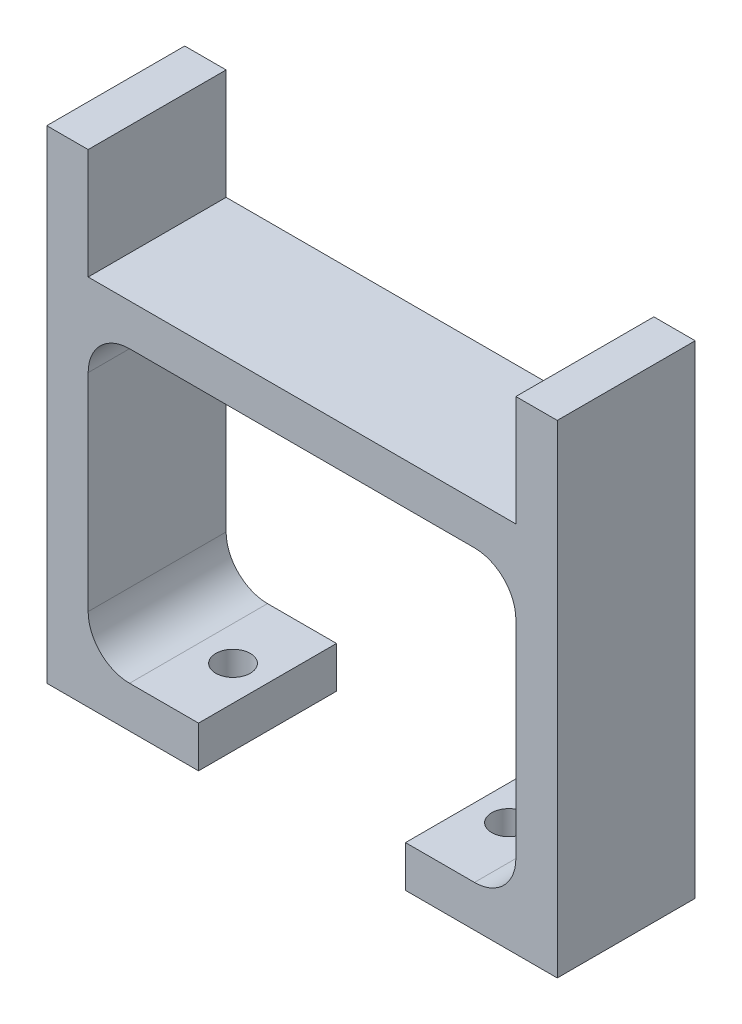
ISO-10303-21;
HEADER;
FILE_DESCRIPTION(('STEP AP214'),'2;1');
FILE_NAME('part.step','',(''),(''),'','','');
FILE_SCHEMA(('AUTOMOTIVE_DESIGN { 1 0 10303 214 1 1 1 1 }'));
ENDSEC;
DATA;
#1=APPLICATION_CONTEXT('core data for automotive mechanical design processes');
#2=APPLICATION_PROTOCOL_DEFINITION('international standard','automotive_design',2000,#1);
#3=PRODUCT_CONTEXT('',#1,'mechanical');
#4=PRODUCT('Part','Part','',(#3));
#5=PRODUCT_RELATED_PRODUCT_CATEGORY('part','',(#4));
#6=PRODUCT_DEFINITION_FORMATION('','',#4);
#7=PRODUCT_DEFINITION_CONTEXT('part definition',#1,'design');
#8=PRODUCT_DEFINITION('design','',#6,#7);
#9=PRODUCT_DEFINITION_SHAPE('','',#8);
#10=(LENGTH_UNIT() NAMED_UNIT(*) SI_UNIT(.MILLI.,.METRE.));
#11=(NAMED_UNIT(*) PLANE_ANGLE_UNIT() SI_UNIT($,.RADIAN.));
#12=(NAMED_UNIT(*) SI_UNIT($,.STERADIAN.) SOLID_ANGLE_UNIT());
#13=UNCERTAINTY_MEASURE_WITH_UNIT(LENGTH_MEASURE(1.E-05),#10,'distance_accuracy_value','');
#14=(GEOMETRIC_REPRESENTATION_CONTEXT(3) GLOBAL_UNCERTAINTY_ASSIGNED_CONTEXT((#13)) GLOBAL_UNIT_ASSIGNED_CONTEXT((#10,
#11,#12)) REPRESENTATION_CONTEXT('',''));
#15=CARTESIAN_POINT('',(0.,0.,0.));
#16=DIRECTION('',(0.,0.,1.));
#17=DIRECTION('',(1.,0.,0.));
#18=AXIS2_PLACEMENT_3D('',#15,#16,#17);
#19=CARTESIAN_POINT('',(-15.5,35.,10.));
#20=DIRECTION('',(-1.,0.,0.));
#21=DIRECTION('',(0.,-1.,0.));
#22=AXIS2_PLACEMENT_3D('',#19,#20,#21);
#23=PLANE('',#22);
#24=DIRECTION('',(0.,1.,0.));
#25=VECTOR('',#24,1.);
#26=CARTESIAN_POINT('',(-15.5,35.,0.));
#27=LINE('',#26,#25);
#28=CARTESIAN_POINT('',(-15.5,27.,0.));
#29=VERTEX_POINT('',#28);
#30=CARTESIAN_POINT('',(-15.5,35.,0.));
#31=VERTEX_POINT('',#30);
#32=EDGE_CURVE('E201',#29,#31,#27,.T.);
#33=ORIENTED_EDGE('',*,*,#32,.T.);
#34=DIRECTION('',(0.,0.,-1.));
#35=VECTOR('',#34,1.);
#36=CARTESIAN_POINT('',(-15.5,35.,10.));
#37=LINE('',#36,#35);
#38=CARTESIAN_POINT('',(-15.5,35.,10.));
#39=VERTEX_POINT('',#38);
#40=EDGE_CURVE('E11',#39,#31,#37,.T.);
#41=ORIENTED_EDGE('',*,*,#40,.F.);
#42=DIRECTION('',(0.,1.,0.));
#43=VECTOR('',#42,1.);
#44=CARTESIAN_POINT('',(-15.5,35.,10.));
#45=LINE('',#44,#43);
#46=CARTESIAN_POINT('',(-15.5,27.,10.));
#47=VERTEX_POINT('',#46);
#48=EDGE_CURVE('E240',#47,#39,#45,.T.);
#49=ORIENTED_EDGE('',*,*,#48,.F.);
#50=DIRECTION('',(0.,0.,-1.));
#51=VECTOR('',#50,1.);
#52=CARTESIAN_POINT('',(-15.5,27.,10.));
#53=LINE('',#52,#51);
#54=EDGE_CURVE('E197',#47,#29,#53,.T.);
#55=ORIENTED_EDGE('',*,*,#54,.T.);
#56=EDGE_LOOP('',(#33,#41,#49,#55));
#57=FACE_BOUND('',#56,.T.);
#58=ADVANCED_FACE('F33',(#57),#23,.F.);
#59=CARTESIAN_POINT('',(-18.5,35.,10.));
#60=DIRECTION('',(0.,-1.,0.));
#61=DIRECTION('',(0.,0.,-1.));
#62=AXIS2_PLACEMENT_3D('',#59,#60,#61);
#63=PLANE('',#62);
#64=DIRECTION('',(-1.,0.,0.));
#65=VECTOR('',#64,1.);
#66=CARTESIAN_POINT('',(-18.5,35.,0.));
#67=LINE('',#66,#65);
#68=CARTESIAN_POINT('',(-18.5,35.,0.));
#69=VERTEX_POINT('',#68);
#70=EDGE_CURVE('E204',#31,#69,#67,.T.);
#71=ORIENTED_EDGE('',*,*,#70,.T.);
#72=DIRECTION('',(0.,0.,-1.));
#73=VECTOR('',#72,1.);
#74=CARTESIAN_POINT('',(-18.5,35.,10.));
#75=LINE('',#74,#73);
#76=CARTESIAN_POINT('',(-18.5,35.,10.));
#77=VERTEX_POINT('',#76);
#78=EDGE_CURVE('E41',#77,#69,#75,.T.);
#79=ORIENTED_EDGE('',*,*,#78,.F.);
#80=DIRECTION('',(-1.,0.,0.));
#81=VECTOR('',#80,1.);
#82=CARTESIAN_POINT('',(-18.5,35.,10.));
#83=LINE('',#82,#81);
#84=EDGE_CURVE('E128',#39,#77,#83,.T.);
#85=ORIENTED_EDGE('',*,*,#84,.F.);
#86=ORIENTED_EDGE('',*,*,#40,.T.);
#87=EDGE_LOOP('',(#71,#79,#85,#86));
#88=FACE_BOUND('',#87,.T.);
#89=ADVANCED_FACE('F358',(#88),#63,.F.);
#90=CARTESIAN_POINT('',(-18.5,0.,10.));
#91=DIRECTION('',(1.,0.,0.));
#92=DIRECTION('',(0.,0.,-1.));
#93=AXIS2_PLACEMENT_3D('',#90,#91,#92);
#94=PLANE('',#93);
#95=DIRECTION('',(0.,-1.,0.));
#96=VECTOR('',#95,1.);
#97=CARTESIAN_POINT('',(-18.5,0.,0.));
#98=LINE('',#97,#96);
#99=CARTESIAN_POINT('',(-18.5,0.,0.));
#100=VERTEX_POINT('',#99);
#101=EDGE_CURVE('E207',#69,#100,#98,.T.);
#102=ORIENTED_EDGE('',*,*,#101,.T.);
#103=DIRECTION('',(0.,0.,-1.));
#104=VECTOR('',#103,1.);
#105=CARTESIAN_POINT('',(-18.5,0.,10.));
#106=LINE('',#105,#104);
#107=CARTESIAN_POINT('',(-18.5,0.,10.));
#108=VERTEX_POINT('',#107);
#109=EDGE_CURVE('E283',#108,#100,#106,.T.);
#110=ORIENTED_EDGE('',*,*,#109,.F.);
#111=DIRECTION('',(0.,-1.,0.));
#112=VECTOR('',#111,1.);
#113=CARTESIAN_POINT('',(-18.5,0.,10.));
#114=LINE('',#113,#112);
#115=EDGE_CURVE('E291',#77,#108,#114,.T.);
#116=ORIENTED_EDGE('',*,*,#115,.F.);
#117=ORIENTED_EDGE('',*,*,#78,.T.);
#118=EDGE_LOOP('',(#102,#110,#116,#117));
#119=FACE_BOUND('',#118,.T.);
#120=ADVANCED_FACE('F289',(#119),#94,.F.);
#121=CARTESIAN_POINT('',(-7.49999999999999,0.,10.));
#122=DIRECTION('',(0.,1.,0.));
#123=DIRECTION('',(-1.,0.,0.));
#124=AXIS2_PLACEMENT_3D('',#121,#122,#123);
#125=PLANE('',#124);
#126=CARTESIAN_POINT('',(-9.99999999999999,0.,5.));
#127=DIRECTION('',(0.,1.,0.));
#128=DIRECTION('',(0.,0.,1.));
#129=AXIS2_PLACEMENT_3D('',#126,#127,#128);
#130=CIRCLE('',#129,1.25);
#131=CARTESIAN_POINT('',(-9.99999999999999,0.,6.25));
#132=VERTEX_POINT('',#131);
#133=EDGE_CURVE('E205',#132,#132,#130,.T.);
#134=ORIENTED_EDGE('',*,*,#133,.T.);
#135=EDGE_LOOP('',(#134));
#136=FACE_BOUND('',#135,.T.);
#137=DIRECTION('',(1.,0.,0.));
#138=VECTOR('',#137,1.);
#139=CARTESIAN_POINT('',(-7.49999999999999,0.,0.));
#140=LINE('',#139,#138);
#141=CARTESIAN_POINT('',(-7.49999999999999,0.,0.));
#142=VERTEX_POINT('',#141);
#143=EDGE_CURVE('E209',#100,#142,#140,.T.);
#144=ORIENTED_EDGE('',*,*,#143,.T.);
#145=DIRECTION('',(0.,0.,-1.));
#146=VECTOR('',#145,1.);
#147=CARTESIAN_POINT('',(-7.49999999999999,0.,10.));
#148=LINE('',#147,#146);
#149=CARTESIAN_POINT('',(-7.49999999999999,0.,10.));
#150=VERTEX_POINT('',#149);
#151=EDGE_CURVE('E280',#150,#142,#148,.T.);
#152=ORIENTED_EDGE('',*,*,#151,.F.);
#153=DIRECTION('',(1.,0.,0.));
#154=VECTOR('',#153,1.);
#155=CARTESIAN_POINT('',(-7.49999999999999,0.,10.));
#156=LINE('',#155,#154);
#157=EDGE_CURVE('E309',#108,#150,#156,.T.);
#158=ORIENTED_EDGE('',*,*,#157,.F.);
#159=ORIENTED_EDGE('',*,*,#109,.T.);
#160=EDGE_LOOP('',(#144,#152,#158,#159));
#161=FACE_BOUND('',#160,.T.);
#162=ADVANCED_FACE('F300',(#136,#161),#125,.F.);
#163=CARTESIAN_POINT('',(-7.49999999999999,3.,10.));
#164=DIRECTION('',(-1.,0.,0.));
#165=DIRECTION('',(0.,0.,1.));
#166=AXIS2_PLACEMENT_3D('',#163,#164,#165);
#167=PLANE('',#166);
#168=DIRECTION('',(0.,1.,0.));
#169=VECTOR('',#168,1.);
#170=CARTESIAN_POINT('',(-7.49999999999999,3.,0.));
#171=LINE('',#170,#169);
#172=CARTESIAN_POINT('',(-7.49999999999999,3.,0.));
#173=VERTEX_POINT('',#172);
#174=EDGE_CURVE('E211',#142,#173,#171,.T.);
#175=ORIENTED_EDGE('',*,*,#174,.T.);
#176=DIRECTION('',(0.,0.,-1.));
#177=VECTOR('',#176,1.);
#178=CARTESIAN_POINT('',(-7.49999999999999,3.,10.));
#179=LINE('',#178,#177);
#180=CARTESIAN_POINT('',(-7.49999999999999,3.,10.));
#181=VERTEX_POINT('',#180);
#182=EDGE_CURVE('E277',#181,#173,#179,.T.);
#183=ORIENTED_EDGE('',*,*,#182,.F.);
#184=DIRECTION('',(0.,1.,0.));
#185=VECTOR('',#184,1.);
#186=CARTESIAN_POINT('',(-7.49999999999999,3.,10.));
#187=LINE('',#186,#185);
#188=EDGE_CURVE('E306',#150,#181,#187,.T.);
#189=ORIENTED_EDGE('',*,*,#188,.F.);
#190=ORIENTED_EDGE('',*,*,#151,.T.);
#191=EDGE_LOOP('',(#175,#183,#189,#190));
#192=FACE_BOUND('',#191,.T.);
#193=ADVANCED_FACE('F304',(#192),#167,.F.);
#194=CARTESIAN_POINT('',(-12.5,3.,10.));
#195=DIRECTION('',(0.,-1.,0.));
#196=DIRECTION('',(1.,0.,0.));
#197=AXIS2_PLACEMENT_3D('',#194,#195,#196);
#198=PLANE('',#197);
#199=CARTESIAN_POINT('',(-9.99999999999999,3.,5.));
#200=DIRECTION('',(0.,1.,0.));
#201=DIRECTION('',(0.,0.,1.));
#202=AXIS2_PLACEMENT_3D('',#199,#200,#201);
#203=CIRCLE('',#202,1.25);
#204=CARTESIAN_POINT('',(-9.99999999999999,3.,6.25));
#205=VERTEX_POINT('',#204);
#206=EDGE_CURVE('E502',#205,#205,#203,.T.);
#207=ORIENTED_EDGE('',*,*,#206,.F.);
#208=EDGE_LOOP('',(#207));
#209=FACE_BOUND('',#208,.T.);
#210=DIRECTION('',(-1.,0.,0.));
#211=VECTOR('',#210,1.);
#212=CARTESIAN_POINT('',(-12.5,3.,0.));
#213=LINE('',#212,#211);
#214=CARTESIAN_POINT('',(-12.5,3.,0.));
#215=VERTEX_POINT('',#214);
#216=EDGE_CURVE('E213',#173,#215,#213,.T.);
#217=ORIENTED_EDGE('',*,*,#216,.T.);
#218=DIRECTION('',(0.,0.,-1.));
#219=VECTOR('',#218,1.);
#220=CARTESIAN_POINT('',(-12.5,3.,10.));
#221=LINE('',#220,#219);
#222=CARTESIAN_POINT('',(-12.5,3.,10.));
#223=VERTEX_POINT('',#222);
#224=EDGE_CURVE('E274',#223,#215,#221,.T.);
#225=ORIENTED_EDGE('',*,*,#224,.F.);
#226=DIRECTION('',(-1.,0.,0.));
#227=VECTOR('',#226,1.);
#228=CARTESIAN_POINT('',(-12.5,3.,10.));
#229=LINE('',#228,#227);
#230=EDGE_CURVE('E308',#181,#223,#229,.T.);
#231=ORIENTED_EDGE('',*,*,#230,.F.);
#232=ORIENTED_EDGE('',*,*,#182,.T.);
#233=EDGE_LOOP('',(#217,#225,#231,#232));
#234=FACE_BOUND('',#233,.T.);
#235=ADVANCED_FACE('F372',(#209,#234),#198,.F.);
#236=CARTESIAN_POINT('',(-12.5,6.,10.));
#237=DIRECTION('',(0.,0.,-1.));
#238=DIRECTION('',(-1.,0.,0.));
#239=AXIS2_PLACEMENT_3D('',#236,#237,#238);
#240=CYLINDRICAL_SURFACE('',#239,2.99999999999999);
#241=CARTESIAN_POINT('',(-12.5,6.,0.));
#242=DIRECTION('',(0.,0.,-1.));
#243=DIRECTION('',(-1.,0.,0.));
#244=AXIS2_PLACEMENT_3D('',#241,#242,#243);
#245=CIRCLE('',#244,2.99999999999999);
#246=CARTESIAN_POINT('',(-15.5,6.,0.));
#247=VERTEX_POINT('',#246);
#248=EDGE_CURVE('E215',#215,#247,#245,.T.);
#249=ORIENTED_EDGE('',*,*,#248,.T.);
#250=DIRECTION('',(0.,0.,-1.));
#251=VECTOR('',#250,1.);
#252=CARTESIAN_POINT('',(-15.5,6.,10.));
#253=LINE('',#252,#251);
#254=CARTESIAN_POINT('',(-15.5,6.,10.));
#255=VERTEX_POINT('',#254);
#256=EDGE_CURVE('E271',#255,#247,#253,.T.);
#257=ORIENTED_EDGE('',*,*,#256,.F.);
#258=CARTESIAN_POINT('',(-12.5,6.,10.));
#259=DIRECTION('',(0.,0.,-1.));
#260=DIRECTION('',(-1.,0.,0.));
#261=AXIS2_PLACEMENT_3D('',#258,#259,#260);
#262=CIRCLE('',#261,2.99999999999999);
#263=EDGE_CURVE('E311',#223,#255,#262,.T.);
#264=ORIENTED_EDGE('',*,*,#263,.F.);
#265=ORIENTED_EDGE('',*,*,#224,.T.);
#266=EDGE_LOOP('',(#249,#257,#264,#265));
#267=FACE_BOUND('',#266,.T.);
#268=ADVANCED_FACE('F375',(#267),#240,.F.);
#269=CARTESIAN_POINT('',(-15.5,21.,10.));
#270=DIRECTION('',(-1.,0.,0.));
#271=DIRECTION('',(0.,-1.,0.));
#272=AXIS2_PLACEMENT_3D('',#269,#270,#271);
#273=PLANE('',#272);
#274=DIRECTION('',(0.,1.,0.));
#275=VECTOR('',#274,1.);
#276=CARTESIAN_POINT('',(-15.5,21.,0.));
#277=LINE('',#276,#275);
#278=CARTESIAN_POINT('',(-15.5,21.,0.));
#279=VERTEX_POINT('',#278);
#280=EDGE_CURVE('E217',#247,#279,#277,.T.);
#281=ORIENTED_EDGE('',*,*,#280,.T.);
#282=DIRECTION('',(0.,0.,-1.));
#283=VECTOR('',#282,1.);
#284=CARTESIAN_POINT('',(-15.5,21.,10.));
#285=LINE('',#284,#283);
#286=CARTESIAN_POINT('',(-15.5,21.,10.));
#287=VERTEX_POINT('',#286);
#288=EDGE_CURVE('E268',#287,#279,#285,.T.);
#289=ORIENTED_EDGE('',*,*,#288,.F.);
#290=DIRECTION('',(0.,1.,0.));
#291=VECTOR('',#290,1.);
#292=CARTESIAN_POINT('',(-15.5,21.,10.));
#293=LINE('',#292,#291);
#294=EDGE_CURVE('E317',#255,#287,#293,.T.);
#295=ORIENTED_EDGE('',*,*,#294,.F.);
#296=ORIENTED_EDGE('',*,*,#256,.T.);
#297=EDGE_LOOP('',(#281,#289,#295,#296));
#298=FACE_BOUND('',#297,.T.);
#299=ADVANCED_FACE('F379',(#298),#273,.F.);
#300=CARTESIAN_POINT('',(-12.5,21.,10.));
#301=DIRECTION('',(0.,0.,-1.));
#302=DIRECTION('',(-1.,0.,0.));
#303=AXIS2_PLACEMENT_3D('',#300,#301,#302);
#304=CYLINDRICAL_SURFACE('',#303,3.);
#305=CARTESIAN_POINT('',(-12.5,21.,0.));
#306=DIRECTION('',(0.,0.,-1.));
#307=DIRECTION('',(-1.,0.,0.));
#308=AXIS2_PLACEMENT_3D('',#305,#306,#307);
#309=CIRCLE('',#308,3.);
#310=CARTESIAN_POINT('',(-12.5,24.,0.));
#311=VERTEX_POINT('',#310);
#312=EDGE_CURVE('E219',#279,#311,#309,.T.);
#313=ORIENTED_EDGE('',*,*,#312,.T.);
#314=DIRECTION('',(0.,0.,-1.));
#315=VECTOR('',#314,1.);
#316=CARTESIAN_POINT('',(-12.5,24.,10.));
#317=LINE('',#316,#315);
#318=CARTESIAN_POINT('',(-12.5,24.,10.));
#319=VERTEX_POINT('',#318);
#320=EDGE_CURVE('E265',#319,#311,#317,.T.);
#321=ORIENTED_EDGE('',*,*,#320,.F.);
#322=CARTESIAN_POINT('',(-12.5,21.,10.));
#323=DIRECTION('',(0.,0.,-1.));
#324=DIRECTION('',(-1.,0.,0.));
#325=AXIS2_PLACEMENT_3D('',#322,#323,#324);
#326=CIRCLE('',#325,3.);
#327=EDGE_CURVE('E319',#287,#319,#326,.T.);
#328=ORIENTED_EDGE('',*,*,#327,.F.);
#329=ORIENTED_EDGE('',*,*,#288,.T.);
#330=EDGE_LOOP('',(#313,#321,#328,#329));
#331=FACE_BOUND('',#330,.T.);
#332=ADVANCED_FACE('F383',(#331),#304,.F.);
#333=CARTESIAN_POINT('',(12.5,24.,10.));
#334=DIRECTION('',(0.,1.,0.));
#335=DIRECTION('',(0.,0.,1.));
#336=AXIS2_PLACEMENT_3D('',#333,#334,#335);
#337=PLANE('',#336);
#338=DIRECTION('',(1.,0.,0.));
#339=VECTOR('',#338,1.);
#340=CARTESIAN_POINT('',(12.5,24.,0.));
#341=LINE('',#340,#339);
#342=CARTESIAN_POINT('',(12.5,24.,0.));
#343=VERTEX_POINT('',#342);
#344=EDGE_CURVE('E221',#311,#343,#341,.T.);
#345=ORIENTED_EDGE('',*,*,#344,.T.);
#346=DIRECTION('',(0.,0.,-1.));
#347=VECTOR('',#346,1.);
#348=CARTESIAN_POINT('',(12.5,24.,10.));
#349=LINE('',#348,#347);
#350=CARTESIAN_POINT('',(12.5,24.,10.));
#351=VERTEX_POINT('',#350);
#352=EDGE_CURVE('E262',#351,#343,#349,.T.);
#353=ORIENTED_EDGE('',*,*,#352,.F.);
#354=DIRECTION('',(1.,0.,0.));
#355=VECTOR('',#354,1.);
#356=CARTESIAN_POINT('',(12.5,24.,10.));
#357=LINE('',#356,#355);
#358=EDGE_CURVE('E321',#319,#351,#357,.T.);
#359=ORIENTED_EDGE('',*,*,#358,.F.);
#360=ORIENTED_EDGE('',*,*,#320,.T.);
#361=EDGE_LOOP('',(#345,#353,#359,#360));
#362=FACE_BOUND('',#361,.T.);
#363=ADVANCED_FACE('F387',(#362),#337,.F.);
#364=CARTESIAN_POINT('',(12.5,21.,10.));
#365=DIRECTION('',(0.,0.,-1.));
#366=DIRECTION('',(-1.,0.,0.));
#367=AXIS2_PLACEMENT_3D('',#364,#365,#366);
#368=CYLINDRICAL_SURFACE('',#367,3.);
#369=CARTESIAN_POINT('',(12.5,21.,0.));
#370=DIRECTION('',(0.,0.,-1.));
#371=DIRECTION('',(1.,0.,0.));
#372=AXIS2_PLACEMENT_3D('',#369,#370,#371);
#373=CIRCLE('',#372,3.);
#374=CARTESIAN_POINT('',(15.5,21.,0.));
#375=VERTEX_POINT('',#374);
#376=EDGE_CURVE('E223',#343,#375,#373,.T.);
#377=ORIENTED_EDGE('',*,*,#376,.T.);
#378=DIRECTION('',(0.,0.,-1.));
#379=VECTOR('',#378,1.);
#380=CARTESIAN_POINT('',(15.5,21.,10.));
#381=LINE('',#380,#379);
#382=CARTESIAN_POINT('',(15.5,21.,10.));
#383=VERTEX_POINT('',#382);
#384=EDGE_CURVE('E259',#383,#375,#381,.T.);
#385=ORIENTED_EDGE('',*,*,#384,.F.);
#386=CARTESIAN_POINT('',(12.5,21.,10.));
#387=DIRECTION('',(0.,0.,-1.));
#388=DIRECTION('',(1.,0.,0.));
#389=AXIS2_PLACEMENT_3D('',#386,#387,#388);
#390=CIRCLE('',#389,3.);
#391=EDGE_CURVE('E323',#351,#383,#390,.T.);
#392=ORIENTED_EDGE('',*,*,#391,.F.);
#393=ORIENTED_EDGE('',*,*,#352,.T.);
#394=EDGE_LOOP('',(#377,#385,#392,#393));
#395=FACE_BOUND('',#394,.T.);
#396=ADVANCED_FACE('F391',(#395),#368,.F.);
#397=CARTESIAN_POINT('',(15.5,6.,10.));
#398=DIRECTION('',(1.,0.,0.));
#399=DIRECTION('',(0.,1.,0.));
#400=AXIS2_PLACEMENT_3D('',#397,#398,#399);
#401=PLANE('',#400);
#402=DIRECTION('',(0.,-1.,0.));
#403=VECTOR('',#402,1.);
#404=CARTESIAN_POINT('',(15.5,6.,0.));
#405=LINE('',#404,#403);
#406=CARTESIAN_POINT('',(15.5,6.,0.));
#407=VERTEX_POINT('',#406);
#408=EDGE_CURVE('E225',#375,#407,#405,.T.);
#409=ORIENTED_EDGE('',*,*,#408,.T.);
#410=DIRECTION('',(0.,0.,-1.));
#411=VECTOR('',#410,1.);
#412=CARTESIAN_POINT('',(15.5,6.,10.));
#413=LINE('',#412,#411);
#414=CARTESIAN_POINT('',(15.5,6.,10.));
#415=VERTEX_POINT('',#414);
#416=EDGE_CURVE('E256',#415,#407,#413,.T.);
#417=ORIENTED_EDGE('',*,*,#416,.F.);
#418=DIRECTION('',(0.,-1.,0.));
#419=VECTOR('',#418,1.);
#420=CARTESIAN_POINT('',(15.5,6.,10.));
#421=LINE('',#420,#419);
#422=EDGE_CURVE('E325',#383,#415,#421,.T.);
#423=ORIENTED_EDGE('',*,*,#422,.F.);
#424=ORIENTED_EDGE('',*,*,#384,.T.);
#425=EDGE_LOOP('',(#409,#417,#423,#424));
#426=FACE_BOUND('',#425,.T.);
#427=ADVANCED_FACE('F395',(#426),#401,.F.);
#428=CARTESIAN_POINT('',(12.5,6.,10.));
#429=DIRECTION('',(0.,0.,-1.));
#430=DIRECTION('',(-1.,0.,0.));
#431=AXIS2_PLACEMENT_3D('',#428,#429,#430);
#432=CYLINDRICAL_SURFACE('',#431,3.);
#433=CARTESIAN_POINT('',(12.5,6.,0.));
#434=DIRECTION('',(0.,0.,-1.));
#435=DIRECTION('',(-1.,0.,0.));
#436=AXIS2_PLACEMENT_3D('',#433,#434,#435);
#437=CIRCLE('',#436,3.);
#438=CARTESIAN_POINT('',(12.5,3.,0.));
#439=VERTEX_POINT('',#438);
#440=EDGE_CURVE('E227',#407,#439,#437,.T.);
#441=ORIENTED_EDGE('',*,*,#440,.T.);
#442=DIRECTION('',(0.,0.,-1.));
#443=VECTOR('',#442,1.);
#444=CARTESIAN_POINT('',(12.5,3.,10.));
#445=LINE('',#444,#443);
#446=CARTESIAN_POINT('',(12.5,3.,10.));
#447=VERTEX_POINT('',#446);
#448=EDGE_CURVE('E253',#447,#439,#445,.T.);
#449=ORIENTED_EDGE('',*,*,#448,.F.);
#450=CARTESIAN_POINT('',(12.5,6.,10.));
#451=DIRECTION('',(0.,0.,-1.));
#452=DIRECTION('',(-1.,0.,0.));
#453=AXIS2_PLACEMENT_3D('',#450,#451,#452);
#454=CIRCLE('',#453,3.);
#455=EDGE_CURVE('E327',#415,#447,#454,.T.);
#456=ORIENTED_EDGE('',*,*,#455,.F.);
#457=ORIENTED_EDGE('',*,*,#416,.T.);
#458=EDGE_LOOP('',(#441,#449,#456,#457));
#459=FACE_BOUND('',#458,.T.);
#460=ADVANCED_FACE('F399',(#459),#432,.F.);
#461=CARTESIAN_POINT('',(7.49999999999999,3.,10.));
#462=DIRECTION('',(0.,-1.,0.));
#463=DIRECTION('',(1.,0.,0.));
#464=AXIS2_PLACEMENT_3D('',#461,#462,#463);
#465=PLANE('',#464);
#466=CARTESIAN_POINT('',(9.99999999999998,3.,5.));
#467=DIRECTION('',(0.,1.,0.));
#468=DIRECTION('',(0.,0.,1.));
#469=AXIS2_PLACEMENT_3D('',#466,#467,#468);
#470=CIRCLE('',#469,1.25);
#471=CARTESIAN_POINT('',(9.99999999999998,3.,6.25));
#472=VERTEX_POINT('',#471);
#473=EDGE_CURVE('E507',#472,#472,#470,.T.);
#474=ORIENTED_EDGE('',*,*,#473,.F.);
#475=EDGE_LOOP('',(#474));
#476=FACE_BOUND('',#475,.T.);
#477=DIRECTION('',(-1.,0.,0.));
#478=VECTOR('',#477,1.);
#479=CARTESIAN_POINT('',(7.49999999999999,3.,0.));
#480=LINE('',#479,#478);
#481=CARTESIAN_POINT('',(7.49999999999999,3.,0.));
#482=VERTEX_POINT('',#481);
#483=EDGE_CURVE('E229',#439,#482,#480,.T.);
#484=ORIENTED_EDGE('',*,*,#483,.T.);
#485=DIRECTION('',(0.,0.,-1.));
#486=VECTOR('',#485,1.);
#487=CARTESIAN_POINT('',(7.49999999999999,3.,10.));
#488=LINE('',#487,#486);
#489=CARTESIAN_POINT('',(7.49999999999999,3.,10.));
#490=VERTEX_POINT('',#489);
#491=EDGE_CURVE('E250',#490,#482,#488,.T.);
#492=ORIENTED_EDGE('',*,*,#491,.F.);
#493=DIRECTION('',(-1.,0.,0.));
#494=VECTOR('',#493,1.);
#495=CARTESIAN_POINT('',(7.49999999999999,3.,10.));
#496=LINE('',#495,#494);
#497=EDGE_CURVE('E329',#447,#490,#496,.T.);
#498=ORIENTED_EDGE('',*,*,#497,.F.);
#499=ORIENTED_EDGE('',*,*,#448,.T.);
#500=EDGE_LOOP('',(#484,#492,#498,#499));
#501=FACE_BOUND('',#500,.T.);
#502=ADVANCED_FACE('F403',(#476,#501),#465,.F.);
#503=CARTESIAN_POINT('',(7.49999999999999,0.,10.));
#504=DIRECTION('',(1.,0.,0.));
#505=DIRECTION('',(0.,0.,-1.));
#506=AXIS2_PLACEMENT_3D('',#503,#504,#505);
#507=PLANE('',#506);
#508=DIRECTION('',(0.,-1.,0.));
#509=VECTOR('',#508,1.);
#510=CARTESIAN_POINT('',(7.49999999999999,0.,0.));
#511=LINE('',#510,#509);
#512=CARTESIAN_POINT('',(7.49999999999999,0.,0.));
#513=VERTEX_POINT('',#512);
#514=EDGE_CURVE('E231',#482,#513,#511,.T.);
#515=ORIENTED_EDGE('',*,*,#514,.T.);
#516=DIRECTION('',(0.,0.,-1.));
#517=VECTOR('',#516,1.);
#518=CARTESIAN_POINT('',(7.49999999999999,0.,10.));
#519=LINE('',#518,#517);
#520=CARTESIAN_POINT('',(7.49999999999999,0.,10.));
#521=VERTEX_POINT('',#520);
#522=EDGE_CURVE('E247',#521,#513,#519,.T.);
#523=ORIENTED_EDGE('',*,*,#522,.F.);
#524=DIRECTION('',(0.,-1.,0.));
#525=VECTOR('',#524,1.);
#526=CARTESIAN_POINT('',(7.49999999999999,0.,10.));
#527=LINE('',#526,#525);
#528=EDGE_CURVE('E331',#490,#521,#527,.T.);
#529=ORIENTED_EDGE('',*,*,#528,.F.);
#530=ORIENTED_EDGE('',*,*,#491,.T.);
#531=EDGE_LOOP('',(#515,#523,#529,#530));
#532=FACE_BOUND('',#531,.T.);
#533=ADVANCED_FACE('F407',(#532),#507,.F.);
#534=CARTESIAN_POINT('',(18.5,0.,10.));
#535=DIRECTION('',(0.,1.,0.));
#536=DIRECTION('',(-1.,0.,0.));
#537=AXIS2_PLACEMENT_3D('',#534,#535,#536);
#538=PLANE('',#537);
#539=CARTESIAN_POINT('',(9.99999999999998,0.,5.));
#540=DIRECTION('',(0.,1.,0.));
#541=DIRECTION('',(0.,0.,1.));
#542=AXIS2_PLACEMENT_3D('',#539,#540,#541);
#543=CIRCLE('',#542,1.25);
#544=CARTESIAN_POINT('',(9.99999999999998,0.,6.25));
#545=VERTEX_POINT('',#544);
#546=EDGE_CURVE('E503',#545,#545,#543,.T.);
#547=ORIENTED_EDGE('',*,*,#546,.T.);
#548=EDGE_LOOP('',(#547));
#549=FACE_BOUND('',#548,.T.);
#550=DIRECTION('',(1.,0.,0.));
#551=VECTOR('',#550,1.);
#552=CARTESIAN_POINT('',(18.5,0.,0.));
#553=LINE('',#552,#551);
#554=CARTESIAN_POINT('',(18.5,0.,0.));
#555=VERTEX_POINT('',#554);
#556=EDGE_CURVE('E233',#513,#555,#553,.T.);
#557=ORIENTED_EDGE('',*,*,#556,.T.);
#558=DIRECTION('',(0.,0.,-1.));
#559=VECTOR('',#558,1.);
#560=CARTESIAN_POINT('',(18.5,0.,10.));
#561=LINE('',#560,#559);
#562=CARTESIAN_POINT('',(18.5,0.,10.));
#563=VERTEX_POINT('',#562);
#564=EDGE_CURVE('E244',#563,#555,#561,.T.);
#565=ORIENTED_EDGE('',*,*,#564,.F.);
#566=DIRECTION('',(1.,0.,0.));
#567=VECTOR('',#566,1.);
#568=CARTESIAN_POINT('',(18.5,0.,10.));
#569=LINE('',#568,#567);
#570=EDGE_CURVE('E333',#521,#563,#569,.T.);
#571=ORIENTED_EDGE('',*,*,#570,.F.);
#572=ORIENTED_EDGE('',*,*,#522,.T.);
#573=EDGE_LOOP('',(#557,#565,#571,#572));
#574=FACE_BOUND('',#573,.T.);
#575=ADVANCED_FACE('F339',(#549,#574),#538,.F.);
#576=CARTESIAN_POINT('',(18.5,35.,10.));
#577=DIRECTION('',(-1.,0.,0.));
#578=DIRECTION('',(0.,-1.,0.));
#579=AXIS2_PLACEMENT_3D('',#576,#577,#578);
#580=PLANE('',#579);
#581=DIRECTION('',(0.,1.,0.));
#582=VECTOR('',#581,1.);
#583=CARTESIAN_POINT('',(18.5,35.,0.));
#584=LINE('',#583,#582);
#585=CARTESIAN_POINT('',(18.5,35.,0.));
#586=VERTEX_POINT('',#585);
#587=EDGE_CURVE('E235',#555,#586,#584,.T.);
#588=ORIENTED_EDGE('',*,*,#587,.T.);
#589=DIRECTION('',(0.,0.,-1.));
#590=VECTOR('',#589,1.);
#591=CARTESIAN_POINT('',(18.5,35.,10.));
#592=LINE('',#591,#590);
#593=CARTESIAN_POINT('',(18.5,35.,10.));
#594=VERTEX_POINT('',#593);
#595=EDGE_CURVE('E192',#594,#586,#592,.T.);
#596=ORIENTED_EDGE('',*,*,#595,.F.);
#597=DIRECTION('',(0.,1.,0.));
#598=VECTOR('',#597,1.);
#599=CARTESIAN_POINT('',(18.5,35.,10.));
#600=LINE('',#599,#598);
#601=EDGE_CURVE('E183',#563,#594,#600,.T.);
#602=ORIENTED_EDGE('',*,*,#601,.F.);
#603=ORIENTED_EDGE('',*,*,#564,.T.);
#604=EDGE_LOOP('',(#588,#596,#602,#603));
#605=FACE_BOUND('',#604,.T.);
#606=ADVANCED_FACE('F343',(#605),#580,.F.);
#607=CARTESIAN_POINT('',(15.5,35.,10.));
#608=DIRECTION('',(0.,-1.,0.));
#609=DIRECTION('',(0.,0.,-1.));
#610=AXIS2_PLACEMENT_3D('',#607,#608,#609);
#611=PLANE('',#610);
#612=DIRECTION('',(-1.,0.,0.));
#613=VECTOR('',#612,1.);
#614=CARTESIAN_POINT('',(15.5,35.,0.));
#615=LINE('',#614,#613);
#616=CARTESIAN_POINT('',(15.5,35.,0.));
#617=VERTEX_POINT('',#616);
#618=EDGE_CURVE('E191',#586,#617,#615,.T.);
#619=ORIENTED_EDGE('',*,*,#618,.T.);
#620=DIRECTION('',(0.,0.,-1.));
#621=VECTOR('',#620,1.);
#622=CARTESIAN_POINT('',(15.5,35.,10.));
#623=LINE('',#622,#621);
#624=CARTESIAN_POINT('',(15.5,35.,10.));
#625=VERTEX_POINT('',#624);
#626=EDGE_CURVE('E188',#625,#617,#623,.T.);
#627=ORIENTED_EDGE('',*,*,#626,.F.);
#628=DIRECTION('',(-1.,0.,0.));
#629=VECTOR('',#628,1.);
#630=CARTESIAN_POINT('',(15.5,35.,10.));
#631=LINE('',#630,#629);
#632=EDGE_CURVE('E177',#594,#625,#631,.T.);
#633=ORIENTED_EDGE('',*,*,#632,.F.);
#634=ORIENTED_EDGE('',*,*,#595,.T.);
#635=EDGE_LOOP('',(#619,#627,#633,#634));
#636=FACE_BOUND('',#635,.T.);
#637=ADVANCED_FACE('F189',(#636),#611,.F.);
#638=CARTESIAN_POINT('',(15.5,27.,10.));
#639=DIRECTION('',(1.,0.,0.));
#640=DIRECTION('',(0.,1.,0.));
#641=AXIS2_PLACEMENT_3D('',#638,#639,#640);
#642=PLANE('',#641);
#643=DIRECTION('',(0.,-1.,0.));
#644=VECTOR('',#643,1.);
#645=CARTESIAN_POINT('',(15.5,27.,0.));
#646=LINE('',#645,#644);
#647=CARTESIAN_POINT('',(15.5,27.,0.));
#648=VERTEX_POINT('',#647);
#649=EDGE_CURVE('E114',#617,#648,#646,.T.);
#650=ORIENTED_EDGE('',*,*,#649,.T.);
#651=DIRECTION('',(0.,0.,-1.));
#652=VECTOR('',#651,1.);
#653=CARTESIAN_POINT('',(15.5,27.,10.));
#654=LINE('',#653,#652);
#655=CARTESIAN_POINT('',(15.5,27.,10.));
#656=VERTEX_POINT('',#655);
#657=EDGE_CURVE('E193',#656,#648,#654,.T.);
#658=ORIENTED_EDGE('',*,*,#657,.F.);
#659=DIRECTION('',(0.,-1.,0.));
#660=VECTOR('',#659,1.);
#661=CARTESIAN_POINT('',(15.5,27.,10.));
#662=LINE('',#661,#660);
#663=EDGE_CURVE('E181',#625,#656,#662,.T.);
#664=ORIENTED_EDGE('',*,*,#663,.F.);
#665=ORIENTED_EDGE('',*,*,#626,.T.);
#666=EDGE_LOOP('',(#650,#658,#664,#665));
#667=FACE_BOUND('',#666,.T.);
#668=ADVANCED_FACE('F195',(#667),#642,.F.);
#669=CARTESIAN_POINT('',(-15.5,27.,10.));
#670=DIRECTION('',(0.,-1.,0.));
#671=DIRECTION('',(0.,0.,-1.));
#672=AXIS2_PLACEMENT_3D('',#669,#670,#671);
#673=PLANE('',#672);
#674=DIRECTION('',(-1.,0.,0.));
#675=VECTOR('',#674,1.);
#676=CARTESIAN_POINT('',(-15.5,27.,0.));
#677=LINE('',#676,#675);
#678=EDGE_CURVE('E120',#648,#29,#677,.T.);
#679=ORIENTED_EDGE('',*,*,#678,.T.);
#680=ORIENTED_EDGE('',*,*,#54,.F.);
#681=DIRECTION('',(-1.,0.,0.));
#682=VECTOR('',#681,1.);
#683=CARTESIAN_POINT('',(-15.5,27.,10.));
#684=LINE('',#683,#682);
#685=EDGE_CURVE('E49',#656,#47,#684,.T.);
#686=ORIENTED_EDGE('',*,*,#685,.F.);
#687=ORIENTED_EDGE('',*,*,#657,.T.);
#688=EDGE_LOOP('',(#679,#680,#686,#687));
#689=FACE_BOUND('',#688,.T.);
#690=ADVANCED_FACE('F347',(#689),#673,.F.);
#691=CARTESIAN_POINT('',(12.5,6.,10.));
#692=DIRECTION('',(0.,0.,-1.));
#693=DIRECTION('',(-1.,0.,0.));
#694=AXIS2_PLACEMENT_3D('',#691,#692,#693);
#695=PLANE('',#694);
#696=ORIENTED_EDGE('',*,*,#48,.T.);
#697=ORIENTED_EDGE('',*,*,#84,.T.);
#698=ORIENTED_EDGE('',*,*,#115,.T.);
#699=ORIENTED_EDGE('',*,*,#157,.T.);
#700=ORIENTED_EDGE('',*,*,#188,.T.);
#701=ORIENTED_EDGE('',*,*,#230,.T.);
#702=ORIENTED_EDGE('',*,*,#263,.T.);
#703=ORIENTED_EDGE('',*,*,#294,.T.);
#704=ORIENTED_EDGE('',*,*,#327,.T.);
#705=ORIENTED_EDGE('',*,*,#358,.T.);
#706=ORIENTED_EDGE('',*,*,#391,.T.);
#707=ORIENTED_EDGE('',*,*,#422,.T.);
#708=ORIENTED_EDGE('',*,*,#455,.T.);
#709=ORIENTED_EDGE('',*,*,#497,.T.);
#710=ORIENTED_EDGE('',*,*,#528,.T.);
#711=ORIENTED_EDGE('',*,*,#570,.T.);
#712=ORIENTED_EDGE('',*,*,#601,.T.);
#713=ORIENTED_EDGE('',*,*,#632,.T.);
#714=ORIENTED_EDGE('',*,*,#663,.T.);
#715=ORIENTED_EDGE('',*,*,#685,.T.);
#716=EDGE_LOOP('',(#696,#697,#698,#699,#700,#701,#702,#703,#704,#705,#706,#707,#708,#709,#710,
#711,#712,#713,#714,#715));
#717=FACE_BOUND('',#716,.T.);
#718=ADVANCED_FACE('F179',(#717),#695,.F.);
#719=CARTESIAN_POINT('',(12.5,6.,0.));
#720=DIRECTION('',(0.,0.,-1.));
#721=DIRECTION('',(-1.,0.,0.));
#722=AXIS2_PLACEMENT_3D('',#719,#720,#721);
#723=PLANE('',#722);
#724=ORIENTED_EDGE('',*,*,#32,.F.);
#725=ORIENTED_EDGE('',*,*,#678,.F.);
#726=ORIENTED_EDGE('',*,*,#649,.F.);
#727=ORIENTED_EDGE('',*,*,#618,.F.);
#728=ORIENTED_EDGE('',*,*,#587,.F.);
#729=ORIENTED_EDGE('',*,*,#556,.F.);
#730=ORIENTED_EDGE('',*,*,#514,.F.);
#731=ORIENTED_EDGE('',*,*,#483,.F.);
#732=ORIENTED_EDGE('',*,*,#440,.F.);
#733=ORIENTED_EDGE('',*,*,#408,.F.);
#734=ORIENTED_EDGE('',*,*,#376,.F.);
#735=ORIENTED_EDGE('',*,*,#344,.F.);
#736=ORIENTED_EDGE('',*,*,#312,.F.);
#737=ORIENTED_EDGE('',*,*,#280,.F.);
#738=ORIENTED_EDGE('',*,*,#248,.F.);
#739=ORIENTED_EDGE('',*,*,#216,.F.);
#740=ORIENTED_EDGE('',*,*,#174,.F.);
#741=ORIENTED_EDGE('',*,*,#143,.F.);
#742=ORIENTED_EDGE('',*,*,#101,.F.);
#743=ORIENTED_EDGE('',*,*,#70,.F.);
#744=EDGE_LOOP('',(#724,#725,#726,#727,#728,#729,#730,#731,#732,#733,#734,#735,#736,#737,#738,
#739,#740,#741,#742,#743));
#745=FACE_BOUND('',#744,.T.);
#746=ADVANCED_FACE('F295',(#745),#723,.T.);
#747=CARTESIAN_POINT('',(9.99999999999998,0.,5.));
#748=DIRECTION('',(0.,1.,0.));
#749=DIRECTION('',(0.,0.,1.));
#750=AXIS2_PLACEMENT_3D('',#747,#748,#749);
#751=CYLINDRICAL_SURFACE('',#750,1.25);
#752=ORIENTED_EDGE('',*,*,#546,.F.);
#753=EDGE_LOOP('',(#752));
#754=FACE_BOUND('',#753,.T.);
#755=ORIENTED_EDGE('',*,*,#473,.T.);
#756=EDGE_LOOP('',(#755));
#757=FACE_BOUND('',#756,.T.);
#758=ADVANCED_FACE('F445',(#754,#757),#751,.F.);
#759=CARTESIAN_POINT('',(-9.99999999999999,0.,5.));
#760=DIRECTION('',(0.,1.,0.));
#761=DIRECTION('',(0.,0.,1.));
#762=AXIS2_PLACEMENT_3D('',#759,#760,#761);
#763=CYLINDRICAL_SURFACE('',#762,1.25);
#764=ORIENTED_EDGE('',*,*,#133,.F.);
#765=EDGE_LOOP('',(#764));
#766=FACE_BOUND('',#765,.T.);
#767=ORIENTED_EDGE('',*,*,#206,.T.);
#768=EDGE_LOOP('',(#767));
#769=FACE_BOUND('',#768,.T.);
#770=ADVANCED_FACE('F483',(#766,#769),#763,.F.);
#771=CLOSED_SHELL('',(#58,#89,#120,#162,#193,#235,#268,#299,#332,#363,#396,#427,#460,#502,#533,
#575,#606,#637,#668,#690,#718,#746,#758,#770));
#772=MANIFOLD_SOLID_BREP('B2',#771);
#773=ADVANCED_BREP_SHAPE_REPRESENTATION('',(#18,#772),#14);
#774=SHAPE_DEFINITION_REPRESENTATION(#9,#773);
ENDSEC;
END-ISO-10303-21;
